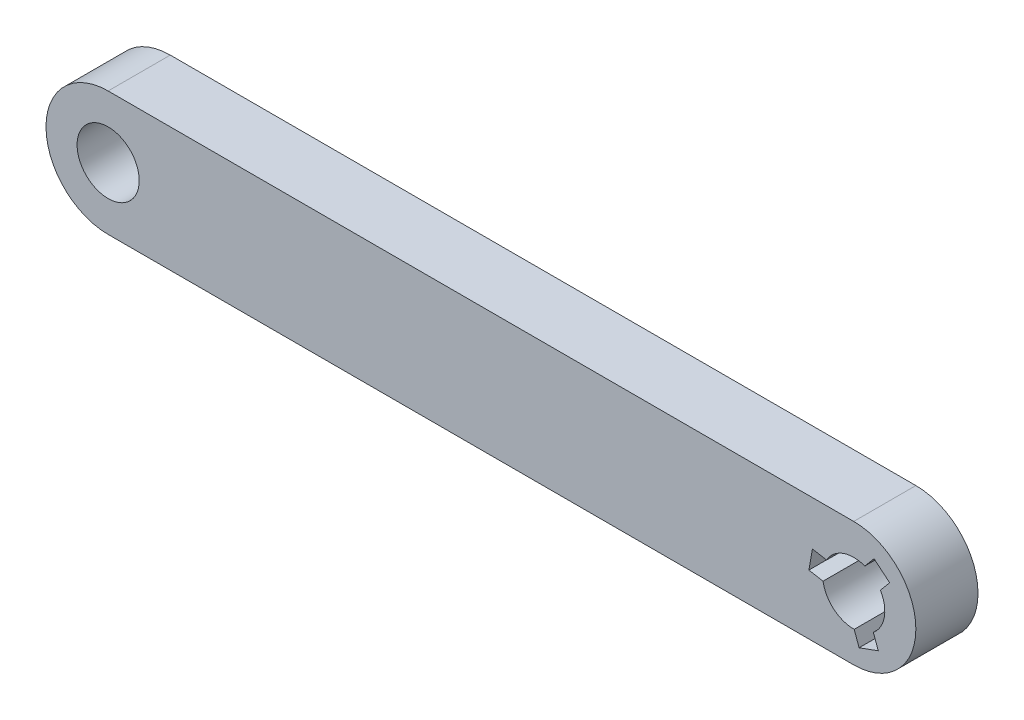
ISO-10303-21;
HEADER;
FILE_DESCRIPTION(('STEP AP214'),'2;1');
FILE_NAME('part.step','',(''),(''),'','','');
FILE_SCHEMA(('AUTOMOTIVE_DESIGN { 1 0 10303 214 1 1 1 1 }'));
ENDSEC;
DATA;
#1=APPLICATION_CONTEXT('core data for automotive mechanical design processes');
#2=APPLICATION_PROTOCOL_DEFINITION('international standard','automotive_design',2000,#1);
#3=PRODUCT_CONTEXT('',#1,'mechanical');
#4=PRODUCT('Part','Part','',(#3));
#5=PRODUCT_RELATED_PRODUCT_CATEGORY('part','',(#4));
#6=PRODUCT_DEFINITION_FORMATION('','',#4);
#7=PRODUCT_DEFINITION_CONTEXT('part definition',#1,'design');
#8=PRODUCT_DEFINITION('design','',#6,#7);
#9=PRODUCT_DEFINITION_SHAPE('','',#8);
#10=(LENGTH_UNIT() NAMED_UNIT(*) SI_UNIT(.MILLI.,.METRE.));
#11=(NAMED_UNIT(*) PLANE_ANGLE_UNIT() SI_UNIT($,.RADIAN.));
#12=(NAMED_UNIT(*) SI_UNIT($,.STERADIAN.) SOLID_ANGLE_UNIT());
#13=UNCERTAINTY_MEASURE_WITH_UNIT(LENGTH_MEASURE(1.E-05),#10,'distance_accuracy_value','');
#14=(GEOMETRIC_REPRESENTATION_CONTEXT(3) GLOBAL_UNCERTAINTY_ASSIGNED_CONTEXT((#13)) GLOBAL_UNIT_ASSIGNED_CONTEXT((#10,
#11,#12)) REPRESENTATION_CONTEXT('',''));
#15=CARTESIAN_POINT('',(0.,0.,0.));
#16=DIRECTION('',(0.,0.,1.));
#17=DIRECTION('',(1.,0.,0.));
#18=AXIS2_PLACEMENT_3D('',#15,#16,#17);
#19=CARTESIAN_POINT('',(0.,-6.35,6.35));
#20=DIRECTION('',(0.,1.,0.));
#21=DIRECTION('',(-1.,0.,0.));
#22=AXIS2_PLACEMENT_3D('',#19,#20,#21);
#23=PLANE('',#22);
#24=DIRECTION('',(1.,0.,0.));
#25=VECTOR('',#24,1.);
#26=CARTESIAN_POINT('',(0.,-6.35,0.));
#27=LINE('',#26,#25);
#28=CARTESIAN_POINT('',(-76.2,-6.35,0.));
#29=VERTEX_POINT('',#28);
#30=CARTESIAN_POINT('',(0.,-6.35,0.));
#31=VERTEX_POINT('',#30);
#32=EDGE_CURVE('E213',#29,#31,#27,.T.);
#33=ORIENTED_EDGE('',*,*,#32,.T.);
#34=DIRECTION('',(0.,0.,-1.));
#35=VECTOR('',#34,1.);
#36=CARTESIAN_POINT('',(0.,-6.35,6.35));
#37=LINE('',#36,#35);
#38=CARTESIAN_POINT('',(0.,-6.35,6.35));
#39=VERTEX_POINT('',#38);
#40=EDGE_CURVE('E11',#39,#31,#37,.T.);
#41=ORIENTED_EDGE('',*,*,#40,.F.);
#42=DIRECTION('',(1.,0.,0.));
#43=VECTOR('',#42,1.);
#44=CARTESIAN_POINT('',(0.,-6.35,6.35));
#45=LINE('',#44,#43);
#46=CARTESIAN_POINT('',(-76.2,-6.35,6.35));
#47=VERTEX_POINT('',#46);
#48=EDGE_CURVE('E166',#47,#39,#45,.T.);
#49=ORIENTED_EDGE('',*,*,#48,.F.);
#50=DIRECTION('',(0.,0.,-1.));
#51=VECTOR('',#50,1.);
#52=CARTESIAN_POINT('',(-76.2,-6.35,6.35));
#53=LINE('',#52,#51);
#54=EDGE_CURVE('E220',#47,#29,#53,.T.);
#55=ORIENTED_EDGE('',*,*,#54,.T.);
#56=EDGE_LOOP('',(#33,#41,#49,#55));
#57=FACE_BOUND('',#56,.T.);
#58=ADVANCED_FACE('F37',(#57),#23,.F.);
#59=CARTESIAN_POINT('',(0.,0.,6.35));
#60=DIRECTION('',(0.,0.,-1.));
#61=DIRECTION('',(-1.,0.,0.));
#62=AXIS2_PLACEMENT_3D('',#59,#60,#61);
#63=CYLINDRICAL_SURFACE('',#62,6.35);
#64=CARTESIAN_POINT('',(0.,0.,0.));
#65=DIRECTION('',(0.,0.,1.));
#66=DIRECTION('',(1.,0.,0.));
#67=AXIS2_PLACEMENT_3D('',#64,#65,#66);
#68=CIRCLE('',#67,6.35);
#69=CARTESIAN_POINT('',(0.,6.35,0.));
#70=VERTEX_POINT('',#69);
#71=EDGE_CURVE('E171',#31,#70,#68,.T.);
#72=ORIENTED_EDGE('',*,*,#71,.T.);
#73=DIRECTION('',(0.,0.,-1.));
#74=VECTOR('',#73,1.);
#75=CARTESIAN_POINT('',(0.,6.35,6.35));
#76=LINE('',#75,#74);
#77=CARTESIAN_POINT('',(0.,6.35,6.35));
#78=VERTEX_POINT('',#77);
#79=EDGE_CURVE('E47',#78,#70,#76,.T.);
#80=ORIENTED_EDGE('',*,*,#79,.F.);
#81=CARTESIAN_POINT('',(0.,0.,6.35));
#82=DIRECTION('',(0.,0.,1.));
#83=DIRECTION('',(1.,0.,0.));
#84=AXIS2_PLACEMENT_3D('',#81,#82,#83);
#85=CIRCLE('',#84,6.35);
#86=EDGE_CURVE('E160',#39,#78,#85,.T.);
#87=ORIENTED_EDGE('',*,*,#86,.F.);
#88=ORIENTED_EDGE('',*,*,#40,.T.);
#89=EDGE_LOOP('',(#72,#80,#87,#88));
#90=FACE_BOUND('',#89,.T.);
#91=ADVANCED_FACE('F170',(#90),#63,.T.);
#92=CARTESIAN_POINT('',(0.,6.35,6.35));
#93=DIRECTION('',(0.,-1.,0.));
#94=DIRECTION('',(0.,0.,-1.));
#95=AXIS2_PLACEMENT_3D('',#92,#93,#94);
#96=PLANE('',#95);
#97=DIRECTION('',(-1.,0.,0.));
#98=VECTOR('',#97,1.);
#99=CARTESIAN_POINT('',(0.,6.35,0.));
#100=LINE('',#99,#98);
#101=CARTESIAN_POINT('',(-76.2,6.35,0.));
#102=VERTEX_POINT('',#101);
#103=EDGE_CURVE('E109',#70,#102,#100,.T.);
#104=ORIENTED_EDGE('',*,*,#103,.T.);
#105=DIRECTION('',(0.,0.,-1.));
#106=VECTOR('',#105,1.);
#107=CARTESIAN_POINT('',(-76.2,6.35,6.35));
#108=LINE('',#107,#106);
#109=CARTESIAN_POINT('',(-76.2,6.35,6.35));
#110=VERTEX_POINT('',#109);
#111=EDGE_CURVE('E172',#110,#102,#108,.T.);
#112=ORIENTED_EDGE('',*,*,#111,.F.);
#113=DIRECTION('',(-1.,0.,0.));
#114=VECTOR('',#113,1.);
#115=CARTESIAN_POINT('',(0.,6.35,6.35));
#116=LINE('',#115,#114);
#117=EDGE_CURVE('E164',#78,#110,#116,.T.);
#118=ORIENTED_EDGE('',*,*,#117,.F.);
#119=ORIENTED_EDGE('',*,*,#79,.T.);
#120=EDGE_LOOP('',(#104,#112,#118,#119));
#121=FACE_BOUND('',#120,.T.);
#122=ADVANCED_FACE('F174',(#121),#96,.F.);
#123=CARTESIAN_POINT('',(0.,0.,6.35));
#124=DIRECTION('',(0.,0.,-1.));
#125=DIRECTION('',(-1.,0.,0.));
#126=AXIS2_PLACEMENT_3D('',#123,#124,#125);
#127=CYLINDRICAL_SURFACE('',#126,3.175);
#128=CARTESIAN_POINT('',(0.,0.,0.));
#129=DIRECTION('',(0.,0.,1.));
#130=DIRECTION('',(1.,0.,0.));
#131=AXIS2_PLACEMENT_3D('',#128,#129,#130);
#132=CIRCLE('',#131,3.175);
#133=CARTESIAN_POINT('',(2.00443461753442,-2.46228894811914,0.));
#134=VERTEX_POINT('',#133);
#135=CARTESIAN_POINT('',(2.72570483788984,1.62823773961419,0.));
#136=VERTEX_POINT('',#135);
#137=EDGE_CURVE('E180',#134,#136,#132,.T.);
#138=ORIENTED_EDGE('',*,*,#137,.F.);
#139=DIRECTION('',(0.,0.,-1.));
#140=VECTOR('',#139,1.);
#141=CARTESIAN_POINT('',(2.00443461753442,-2.46228894811914,6.35));
#142=LINE('',#141,#140);
#143=CARTESIAN_POINT('',(2.00443461753442,-2.46228894811914,6.35));
#144=VERTEX_POINT('',#143);
#145=EDGE_CURVE('E41',#144,#134,#142,.T.);
#146=ORIENTED_EDGE('',*,*,#145,.F.);
#147=CARTESIAN_POINT('',(0.,0.,6.35));
#148=DIRECTION('',(0.,0.,1.));
#149=DIRECTION('',(1.,0.,0.));
#150=AXIS2_PLACEMENT_3D('',#147,#148,#149);
#151=CIRCLE('',#150,3.175);
#152=CARTESIAN_POINT('',(2.72570483788984,1.62823773961419,6.35));
#153=VERTEX_POINT('',#152);
#154=EDGE_CURVE('E219',#144,#153,#151,.T.);
#155=ORIENTED_EDGE('',*,*,#154,.T.);
#156=DIRECTION('',(0.,0.,-1.));
#157=VECTOR('',#156,1.);
#158=CARTESIAN_POINT('',(2.72570483788984,1.62823773961419,6.35));
#159=LINE('',#158,#157);
#160=EDGE_CURVE('E176',#153,#136,#159,.T.);
#161=ORIENTED_EDGE('',*,*,#160,.T.);
#162=EDGE_LOOP('',(#138,#146,#155,#161));
#163=FACE_BOUND('',#162,.T.);
#164=ADVANCED_FACE('F39',(#163),#127,.F.);
#165=CARTESIAN_POINT('',(0.978595895286449,0.356179777259352,6.35));
#166=DIRECTION('',(0.939692620785909,0.342020143325668,0.));
#167=DIRECTION('',(-0.342020143325668,0.939692620785909,0.));
#168=AXIS2_PLACEMENT_3D('',#165,#166,#167);
#169=PLANE('',#168);
#170=DIRECTION('',(0.342020143325668,-0.939692620785909,0.));
#171=VECTOR('',#170,1.);
#172=CARTESIAN_POINT('',(0.978595895286449,0.356179777259352,0.));
#173=LINE('',#172,#171);
#174=CARTESIAN_POINT('',(2.50756274400951,-3.84462211470197,0.));
#175=VERTEX_POINT('',#174);
#176=EDGE_CURVE('E183',#134,#175,#173,.T.);
#177=ORIENTED_EDGE('',*,*,#176,.T.);
#178=DIRECTION('',(0.,0.,-1.));
#179=VECTOR('',#178,1.);
#180=CARTESIAN_POINT('',(2.50756274400951,-3.84462211470197,6.35));
#181=LINE('',#180,#179);
#182=CARTESIAN_POINT('',(2.50756274400951,-3.84462211470197,6.35));
#183=VERTEX_POINT('',#182);
#184=EDGE_CURVE('E246',#183,#175,#181,.T.);
#185=ORIENTED_EDGE('',*,*,#184,.F.);
#186=DIRECTION('',(0.342020143325668,-0.939692620785909,0.));
#187=VECTOR('',#186,1.);
#188=CARTESIAN_POINT('',(0.978595895286449,0.356179777259352,6.35));
#189=LINE('',#188,#187);
#190=EDGE_CURVE('E255',#144,#183,#189,.T.);
#191=ORIENTED_EDGE('',*,*,#190,.F.);
#192=ORIENTED_EDGE('',*,*,#145,.T.);
#193=EDGE_LOOP('',(#177,#185,#191,#192));
#194=FACE_BOUND('',#193,.T.);
#195=ADVANCED_FACE('F254',(#194),#169,.F.);
#196=CARTESIAN_POINT('',(1.52896684872307,-4.20080189196132,6.35));
#197=DIRECTION('',(0.342020143325669,-0.939692620785909,0.));
#198=DIRECTION('',(0.939692620785909,0.342020143325669,0.));
#199=AXIS2_PLACEMENT_3D('',#196,#197,#198);
#200=PLANE('',#199);
#201=DIRECTION('',(-0.939692620785909,-0.342020143325669,0.));
#202=VECTOR('',#201,1.);
#203=CARTESIAN_POINT('',(1.52896684872307,-4.20080189196132,0.));
#204=LINE('',#203,#202);
#205=CARTESIAN_POINT('',(0.550370953436624,-4.55698166922068,0.));
#206=VERTEX_POINT('',#205);
#207=EDGE_CURVE('E185',#175,#206,#204,.T.);
#208=ORIENTED_EDGE('',*,*,#207,.T.);
#209=DIRECTION('',(0.,0.,-1.));
#210=VECTOR('',#209,1.);
#211=CARTESIAN_POINT('',(0.550370953436624,-4.55698166922068,6.35));
#212=LINE('',#211,#210);
#213=CARTESIAN_POINT('',(0.550370953436624,-4.55698166922068,6.35));
#214=VERTEX_POINT('',#213);
#215=EDGE_CURVE('E244',#214,#206,#212,.T.);
#216=ORIENTED_EDGE('',*,*,#215,.F.);
#217=DIRECTION('',(-0.939692620785909,-0.342020143325669,0.));
#218=VECTOR('',#217,1.);
#219=CARTESIAN_POINT('',(1.52896684872307,-4.20080189196132,6.35));
#220=LINE('',#219,#218);
#221=EDGE_CURVE('E315',#183,#214,#220,.T.);
#222=ORIENTED_EDGE('',*,*,#221,.F.);
#223=ORIENTED_EDGE('',*,*,#184,.T.);
#224=EDGE_LOOP('',(#208,#216,#222,#223));
#225=FACE_BOUND('',#224,.T.);
#226=ADVANCED_FACE('F314',(#225),#200,.F.);
#227=CARTESIAN_POINT('',(-0.978595895286445,-0.356179777259351,6.35));
#228=DIRECTION('',(-0.939692620785909,-0.342020143325669,0.));
#229=DIRECTION('',(0.342020143325669,-0.939692620785909,0.));
#230=AXIS2_PLACEMENT_3D('',#227,#228,#229);
#231=PLANE('',#230);
#232=DIRECTION('',(-0.342020143325669,0.939692620785909,0.));
#233=VECTOR('',#232,1.);
#234=CARTESIAN_POINT('',(-0.978595895286445,-0.356179777259351,0.));
#235=LINE('',#234,#233);
#236=CARTESIAN_POINT('',(0.047242826961528,-3.17464850263784,0.));
#237=VERTEX_POINT('',#236);
#238=EDGE_CURVE('E187',#206,#237,#235,.T.);
#239=ORIENTED_EDGE('',*,*,#238,.T.);
#240=DIRECTION('',(0.,0.,-1.));
#241=VECTOR('',#240,1.);
#242=CARTESIAN_POINT('',(0.047242826961528,-3.17464850263784,6.35));
#243=LINE('',#242,#241);
#244=CARTESIAN_POINT('',(0.047242826961528,-3.17464850263784,6.35));
#245=VERTEX_POINT('',#244);
#246=EDGE_CURVE('E242',#245,#237,#243,.T.);
#247=ORIENTED_EDGE('',*,*,#246,.F.);
#248=DIRECTION('',(-0.342020143325669,0.939692620785909,0.));
#249=VECTOR('',#248,1.);
#250=CARTESIAN_POINT('',(-0.978595895286445,-0.356179777259351,6.35));
#251=LINE('',#250,#249);
#252=EDGE_CURVE('E313',#214,#245,#251,.T.);
#253=ORIENTED_EDGE('',*,*,#252,.F.);
#254=ORIENTED_EDGE('',*,*,#215,.T.);
#255=EDGE_LOOP('',(#239,#247,#253,#254));
#256=FACE_BOUND('',#255,.T.);
#257=ADVANCED_FACE('F311',(#256),#231,.F.);
#258=CARTESIAN_POINT('',(0.,0.,6.35));
#259=DIRECTION('',(0.,0.,-1.));
#260=DIRECTION('',(-1.,0.,0.));
#261=AXIS2_PLACEMENT_3D('',#258,#259,#260);
#262=CYLINDRICAL_SURFACE('',#261,3.175);
#263=CARTESIAN_POINT('',(0.,0.,0.));
#264=DIRECTION('',(0.,0.,1.));
#265=DIRECTION('',(1.,0.,0.));
#266=AXIS2_PLACEMENT_3D('',#263,#264,#265);
#267=CIRCLE('',#266,3.175);
#268=CARTESIAN_POINT('',(-3.13462208929605,-0.504746824950184,0.));
#269=VERTEX_POINT('',#268);
#270=EDGE_CURVE('E190',#269,#237,#267,.T.);
#271=ORIENTED_EDGE('',*,*,#270,.F.);
#272=DIRECTION('',(0.,0.,-1.));
#273=VECTOR('',#272,1.);
#274=CARTESIAN_POINT('',(-3.13462208929605,-0.504746824950184,6.35));
#275=LINE('',#274,#273);
#276=CARTESIAN_POINT('',(-3.13462208929605,-0.504746824950184,6.35));
#277=VERTEX_POINT('',#276);
#278=EDGE_CURVE('E240',#277,#269,#275,.T.);
#279=ORIENTED_EDGE('',*,*,#278,.F.);
#280=CARTESIAN_POINT('',(0.,0.,6.35));
#281=DIRECTION('',(0.,0.,1.));
#282=DIRECTION('',(1.,0.,0.));
#283=AXIS2_PLACEMENT_3D('',#280,#281,#282);
#284=CIRCLE('',#283,3.175);
#285=EDGE_CURVE('E308',#277,#245,#284,.T.);
#286=ORIENTED_EDGE('',*,*,#285,.T.);
#287=ORIENTED_EDGE('',*,*,#246,.T.);
#288=EDGE_LOOP('',(#271,#279,#286,#287));
#289=FACE_BOUND('',#288,.T.);
#290=ADVANCED_FACE('F305',(#289),#262,.F.);
#291=CARTESIAN_POINT('',(-0.180837212222342,-1.02557879398692,6.35));
#292=DIRECTION('',(-0.173648177666931,-0.984807753012208,0.));
#293=DIRECTION('',(0.984807753012208,-0.173648177666931,0.));
#294=AXIS2_PLACEMENT_3D('',#291,#292,#293);
#295=PLANE('',#294);
#296=DIRECTION('',(-0.984807753012208,0.173648177666931,0.));
#297=VECTOR('',#296,1.);
#298=CARTESIAN_POINT('',(-0.180837212222342,-1.02557879398692,0.));
#299=LINE('',#298,#297);
#300=CARTESIAN_POINT('',(-4.58332179128812,-0.249301980544669,0.));
#301=VERTEX_POINT('',#300);
#302=EDGE_CURVE('E193',#269,#301,#299,.T.);
#303=ORIENTED_EDGE('',*,*,#302,.T.);
#304=DIRECTION('',(0.,0.,-1.));
#305=VECTOR('',#304,1.);
#306=CARTESIAN_POINT('',(-4.58332179128812,-0.249301980544669,6.35));
#307=LINE('',#306,#305);
#308=CARTESIAN_POINT('',(-4.58332179128812,-0.249301980544669,6.35));
#309=VERTEX_POINT('',#308);
#310=EDGE_CURVE('E237',#309,#301,#307,.T.);
#311=ORIENTED_EDGE('',*,*,#310,.F.);
#312=DIRECTION('',(-0.984807753012208,0.173648177666931,0.));
#313=VECTOR('',#312,1.);
#314=CARTESIAN_POINT('',(-0.180837212222342,-1.02557879398692,6.35));
#315=LINE('',#314,#313);
#316=EDGE_CURVE('E301',#277,#309,#315,.T.);
#317=ORIENTED_EDGE('',*,*,#316,.F.);
#318=ORIENTED_EDGE('',*,*,#278,.T.);
#319=EDGE_LOOP('',(#303,#311,#317,#318));
#320=FACE_BOUND('',#319,.T.);
#321=ADVANCED_FACE('F300',(#320),#295,.F.);
#322=CARTESIAN_POINT('',(-4.40248457906577,0.776276813442248,6.35));
#323=DIRECTION('',(-0.984807753012208,0.173648177666931,0.));
#324=DIRECTION('',(-0.173648177666931,-0.984807753012208,0.));
#325=AXIS2_PLACEMENT_3D('',#322,#323,#324);
#326=PLANE('',#325);
#327=DIRECTION('',(0.173648177666931,0.984807753012208,0.));
#328=VECTOR('',#327,1.);
#329=CARTESIAN_POINT('',(-4.40248457906577,0.776276813442248,0.));
#330=LINE('',#329,#328);
#331=CARTESIAN_POINT('',(-4.22164736684343,1.80185560742916,0.));
#332=VERTEX_POINT('',#331);
#333=EDGE_CURVE('E195',#301,#332,#330,.T.);
#334=ORIENTED_EDGE('',*,*,#333,.T.);
#335=DIRECTION('',(0.,0.,-1.));
#336=VECTOR('',#335,1.);
#337=CARTESIAN_POINT('',(-4.22164736684343,1.80185560742916,6.35));
#338=LINE('',#337,#336);
#339=CARTESIAN_POINT('',(-4.22164736684343,1.80185560742916,6.35));
#340=VERTEX_POINT('',#339);
#341=EDGE_CURVE('E234',#340,#332,#338,.T.);
#342=ORIENTED_EDGE('',*,*,#341,.F.);
#343=DIRECTION('',(0.173648177666931,0.984807753012208,0.));
#344=VECTOR('',#343,1.);
#345=CARTESIAN_POINT('',(-4.40248457906577,0.776276813442248,6.35));
#346=LINE('',#345,#344);
#347=EDGE_CURVE('E296',#309,#340,#346,.T.);
#348=ORIENTED_EDGE('',*,*,#347,.F.);
#349=ORIENTED_EDGE('',*,*,#310,.T.);
#350=EDGE_LOOP('',(#334,#342,#348,#349));
#351=FACE_BOUND('',#350,.T.);
#352=ADVANCED_FACE('F295',(#351),#326,.F.);
#353=CARTESIAN_POINT('',(0.180837212222341,1.02557879398691,6.35));
#354=DIRECTION('',(0.17364817766693,0.984807753012208,0.));
#355=DIRECTION('',(-0.984807753012208,0.17364817766693,0.));
#356=AXIS2_PLACEMENT_3D('',#353,#354,#355);
#357=PLANE('',#356);
#358=DIRECTION('',(0.984807753012208,-0.17364817766693,0.));
#359=VECTOR('',#358,1.);
#360=CARTESIAN_POINT('',(0.180837212222341,1.02557879398691,0.));
#361=LINE('',#360,#359);
#362=CARTESIAN_POINT('',(-2.77294766485136,1.54641076302364,0.));
#363=VERTEX_POINT('',#362);
#364=EDGE_CURVE('E197',#332,#363,#361,.T.);
#365=ORIENTED_EDGE('',*,*,#364,.T.);
#366=DIRECTION('',(0.,0.,-1.));
#367=VECTOR('',#366,1.);
#368=CARTESIAN_POINT('',(-2.77294766485136,1.54641076302364,6.35));
#369=LINE('',#368,#367);
#370=CARTESIAN_POINT('',(-2.77294766485136,1.54641076302364,6.35));
#371=VERTEX_POINT('',#370);
#372=EDGE_CURVE('E232',#371,#363,#369,.T.);
#373=ORIENTED_EDGE('',*,*,#372,.F.);
#374=DIRECTION('',(0.984807753012208,-0.17364817766693,0.));
#375=VECTOR('',#374,1.);
#376=CARTESIAN_POINT('',(0.180837212222341,1.02557879398691,6.35));
#377=LINE('',#376,#375);
#378=EDGE_CURVE('E292',#340,#371,#377,.T.);
#379=ORIENTED_EDGE('',*,*,#378,.F.);
#380=ORIENTED_EDGE('',*,*,#341,.T.);
#381=EDGE_LOOP('',(#365,#373,#379,#380));
#382=FACE_BOUND('',#381,.T.);
#383=ADVANCED_FACE('F289',(#382),#357,.F.);
#384=CARTESIAN_POINT('',(0.,0.,6.35));
#385=DIRECTION('',(0.,0.,-1.));
#386=DIRECTION('',(-1.,0.,0.));
#387=AXIS2_PLACEMENT_3D('',#384,#385,#386);
#388=CYLINDRICAL_SURFACE('',#387,3.175);
#389=CARTESIAN_POINT('',(0.,0.,0.));
#390=DIRECTION('',(0.,0.,1.));
#391=DIRECTION('',(1.,0.,0.));
#392=AXIS2_PLACEMENT_3D('',#389,#390,#391);
#393=CIRCLE('',#392,3.175);
#394=CARTESIAN_POINT('',(1.13018747176163,2.96703577306932,0.));
#395=VERTEX_POINT('',#394);
#396=EDGE_CURVE('E200',#395,#363,#393,.T.);
#397=ORIENTED_EDGE('',*,*,#396,.F.);
#398=DIRECTION('',(0.,0.,-1.));
#399=VECTOR('',#398,1.);
#400=CARTESIAN_POINT('',(1.13018747176163,2.96703577306932,6.35));
#401=LINE('',#400,#399);
#402=CARTESIAN_POINT('',(1.13018747176163,2.96703577306932,6.35));
#403=VERTEX_POINT('',#402);
#404=EDGE_CURVE('E230',#403,#395,#401,.T.);
#405=ORIENTED_EDGE('',*,*,#404,.F.);
#406=CARTESIAN_POINT('',(0.,0.,6.35));
#407=DIRECTION('',(0.,0.,1.));
#408=DIRECTION('',(1.,0.,0.));
#409=AXIS2_PLACEMENT_3D('',#406,#407,#408);
#410=CIRCLE('',#409,3.175);
#411=EDGE_CURVE('E283',#403,#371,#410,.T.);
#412=ORIENTED_EDGE('',*,*,#411,.T.);
#413=ORIENTED_EDGE('',*,*,#372,.T.);
#414=EDGE_LOOP('',(#397,#405,#412,#413));
#415=FACE_BOUND('',#414,.T.);
#416=ADVANCED_FACE('F282',(#415),#388,.F.);
#417=CARTESIAN_POINT('',(-0.797758683064104,0.669399016727563,6.35));
#418=DIRECTION('',(-0.766044443118978,0.64278760968654,0.));
#419=DIRECTION('',(-0.64278760968654,-0.766044443118978,0.));
#420=AXIS2_PLACEMENT_3D('',#417,#418,#419);
#421=PLANE('',#420);
#422=DIRECTION('',(0.64278760968654,0.766044443118978,0.));
#423=VECTOR('',#422,1.);
#424=CARTESIAN_POINT('',(-0.797758683064104,0.669399016727563,0.));
#425=LINE('',#424,#423);
#426=CARTESIAN_POINT('',(2.0757590472786,4.09392409524664,0.));
#427=VERTEX_POINT('',#426);
#428=EDGE_CURVE('E203',#395,#427,#425,.T.);
#429=ORIENTED_EDGE('',*,*,#428,.T.);
#430=DIRECTION('',(0.,0.,-1.));
#431=VECTOR('',#430,1.);
#432=CARTESIAN_POINT('',(2.0757590472786,4.09392409524664,6.35));
#433=LINE('',#432,#431);
#434=CARTESIAN_POINT('',(2.0757590472786,4.09392409524664,6.35));
#435=VERTEX_POINT('',#434);
#436=EDGE_CURVE('E227',#435,#427,#433,.T.);
#437=ORIENTED_EDGE('',*,*,#436,.F.);
#438=DIRECTION('',(0.64278760968654,0.766044443118978,0.));
#439=VECTOR('',#438,1.);
#440=CARTESIAN_POINT('',(-0.797758683064104,0.669399016727563,6.35));
#441=LINE('',#440,#439);
#442=EDGE_CURVE('E278',#403,#435,#441,.T.);
#443=ORIENTED_EDGE('',*,*,#442,.F.);
#444=ORIENTED_EDGE('',*,*,#404,.T.);
#445=EDGE_LOOP('',(#429,#437,#443,#444));
#446=FACE_BOUND('',#445,.T.);
#447=ADVANCED_FACE('F277',(#446),#421,.F.);
#448=CARTESIAN_POINT('',(2.87351773034271,3.42452507851908,6.35));
#449=DIRECTION('',(0.64278760968654,0.766044443118978,0.));
#450=DIRECTION('',(-0.766044443118978,0.64278760968654,0.));
#451=AXIS2_PLACEMENT_3D('',#448,#449,#450);
#452=PLANE('',#451);
#453=DIRECTION('',(0.766044443118978,-0.64278760968654,0.));
#454=VECTOR('',#453,1.);
#455=CARTESIAN_POINT('',(2.87351773034271,3.42452507851908,0.));
#456=LINE('',#455,#454);
#457=CARTESIAN_POINT('',(3.67127641340681,2.75512606179152,0.));
#458=VERTEX_POINT('',#457);
#459=EDGE_CURVE('E205',#427,#458,#456,.T.);
#460=ORIENTED_EDGE('',*,*,#459,.T.);
#461=DIRECTION('',(0.,0.,-1.));
#462=VECTOR('',#461,1.);
#463=CARTESIAN_POINT('',(3.67127641340681,2.75512606179152,6.35));
#464=LINE('',#463,#462);
#465=CARTESIAN_POINT('',(3.67127641340681,2.75512606179152,6.35));
#466=VERTEX_POINT('',#465);
#467=EDGE_CURVE('E224',#466,#458,#464,.T.);
#468=ORIENTED_EDGE('',*,*,#467,.F.);
#469=DIRECTION('',(0.766044443118978,-0.64278760968654,0.));
#470=VECTOR('',#469,1.);
#471=CARTESIAN_POINT('',(2.87351773034271,3.42452507851908,6.35));
#472=LINE('',#471,#470);
#473=EDGE_CURVE('E274',#435,#466,#472,.T.);
#474=ORIENTED_EDGE('',*,*,#473,.F.);
#475=ORIENTED_EDGE('',*,*,#436,.T.);
#476=EDGE_LOOP('',(#460,#468,#474,#475));
#477=FACE_BOUND('',#476,.T.);
#478=ADVANCED_FACE('F271',(#477),#452,.F.);
#479=CARTESIAN_POINT('',(-76.2,0.,6.35));
#480=DIRECTION('',(0.,0.,-1.));
#481=DIRECTION('',(-1.,0.,0.));
#482=AXIS2_PLACEMENT_3D('',#479,#480,#481);
#483=CYLINDRICAL_SURFACE('',#482,3.175);
#484=CARTESIAN_POINT('',(-76.2,0.,6.35));
#485=DIRECTION('',(0.,0.,1.));
#486=DIRECTION('',(1.,0.,0.));
#487=AXIS2_PLACEMENT_3D('',#484,#485,#486);
#488=CIRCLE('',#487,3.175);
#489=CARTESIAN_POINT('',(-73.025,0.,6.35));
#490=VERTEX_POINT('',#489);
#491=EDGE_CURVE('E331',#490,#490,#488,.T.);
#492=ORIENTED_EDGE('',*,*,#491,.T.);
#493=EDGE_LOOP('',(#492));
#494=FACE_BOUND('',#493,.T.);
#495=CARTESIAN_POINT('',(-76.2,0.,0.));
#496=DIRECTION('',(0.,0.,1.));
#497=DIRECTION('',(1.,0.,0.));
#498=AXIS2_PLACEMENT_3D('',#495,#496,#497);
#499=CIRCLE('',#498,3.175);
#500=CARTESIAN_POINT('',(-73.025,0.,0.));
#501=VERTEX_POINT('',#500);
#502=EDGE_CURVE('E210',#501,#501,#499,.T.);
#503=ORIENTED_EDGE('',*,*,#502,.F.);
#504=EDGE_LOOP('',(#503));
#505=FACE_BOUND('',#504,.T.);
#506=ADVANCED_FACE('F335',(#494,#505),#483,.F.);
#507=CARTESIAN_POINT('',(0.797758683064103,-0.669399016727562,6.35));
#508=DIRECTION('',(0.766044443118978,-0.64278760968654,0.));
#509=DIRECTION('',(0.64278760968654,0.766044443118978,0.));
#510=AXIS2_PLACEMENT_3D('',#507,#508,#509);
#511=PLANE('',#510);
#512=DIRECTION('',(-0.64278760968654,-0.766044443118978,0.));
#513=VECTOR('',#512,1.);
#514=CARTESIAN_POINT('',(0.797758683064103,-0.669399016727562,0.));
#515=LINE('',#514,#513);
#516=EDGE_CURVE('E207',#458,#136,#515,.T.);
#517=ORIENTED_EDGE('',*,*,#516,.T.);
#518=ORIENTED_EDGE('',*,*,#160,.F.);
#519=DIRECTION('',(-0.64278760968654,-0.766044443118978,0.));
#520=VECTOR('',#519,1.);
#521=CARTESIAN_POINT('',(0.797758683064103,-0.669399016727562,6.35));
#522=LINE('',#521,#520);
#523=EDGE_CURVE('E329',#466,#153,#522,.T.);
#524=ORIENTED_EDGE('',*,*,#523,.F.);
#525=ORIENTED_EDGE('',*,*,#467,.T.);
#526=EDGE_LOOP('',(#517,#518,#524,#525));
#527=FACE_BOUND('',#526,.T.);
#528=ADVANCED_FACE('F265',(#527),#511,.F.);
#529=CARTESIAN_POINT('',(-76.2,0.,6.35));
#530=DIRECTION('',(0.,0.,-1.));
#531=DIRECTION('',(-1.,0.,0.));
#532=AXIS2_PLACEMENT_3D('',#529,#530,#531);
#533=CYLINDRICAL_SURFACE('',#532,6.35);
#534=CARTESIAN_POINT('',(-76.2,0.,0.));
#535=DIRECTION('',(0.,0.,1.));
#536=DIRECTION('',(1.,0.,0.));
#537=AXIS2_PLACEMENT_3D('',#534,#535,#536);
#538=CIRCLE('',#537,6.35);
#539=EDGE_CURVE('E115',#102,#29,#538,.T.);
#540=ORIENTED_EDGE('',*,*,#539,.T.);
#541=ORIENTED_EDGE('',*,*,#54,.F.);
#542=CARTESIAN_POINT('',(-76.2,0.,6.35));
#543=DIRECTION('',(0.,0.,1.));
#544=DIRECTION('',(1.,0.,0.));
#545=AXIS2_PLACEMENT_3D('',#542,#543,#544);
#546=CIRCLE('',#545,6.35);
#547=EDGE_CURVE('E56',#110,#47,#546,.T.);
#548=ORIENTED_EDGE('',*,*,#547,.F.);
#549=ORIENTED_EDGE('',*,*,#111,.T.);
#550=EDGE_LOOP('',(#540,#541,#548,#549));
#551=FACE_BOUND('',#550,.T.);
#552=ADVANCED_FACE('F339',(#551),#533,.T.);
#553=CARTESIAN_POINT('',(0.,0.,6.35));
#554=DIRECTION('',(0.,0.,1.));
#555=DIRECTION('',(1.,0.,0.));
#556=AXIS2_PLACEMENT_3D('',#553,#554,#555);
#557=PLANE('',#556);
#558=ORIENTED_EDGE('',*,*,#154,.F.);
#559=ORIENTED_EDGE('',*,*,#190,.T.);
#560=ORIENTED_EDGE('',*,*,#221,.T.);
#561=ORIENTED_EDGE('',*,*,#252,.T.);
#562=ORIENTED_EDGE('',*,*,#285,.F.);
#563=ORIENTED_EDGE('',*,*,#316,.T.);
#564=ORIENTED_EDGE('',*,*,#347,.T.);
#565=ORIENTED_EDGE('',*,*,#378,.T.);
#566=ORIENTED_EDGE('',*,*,#411,.F.);
#567=ORIENTED_EDGE('',*,*,#442,.T.);
#568=ORIENTED_EDGE('',*,*,#473,.T.);
#569=ORIENTED_EDGE('',*,*,#523,.T.);
#570=EDGE_LOOP('',(#558,#559,#560,#561,#562,#563,#564,#565,#566,#567,#568,#569));
#571=FACE_BOUND('',#570,.T.);
#572=ORIENTED_EDGE('',*,*,#491,.F.);
#573=EDGE_LOOP('',(#572));
#574=FACE_BOUND('',#573,.T.);
#575=ORIENTED_EDGE('',*,*,#48,.T.);
#576=ORIENTED_EDGE('',*,*,#86,.T.);
#577=ORIENTED_EDGE('',*,*,#117,.T.);
#578=ORIENTED_EDGE('',*,*,#547,.T.);
#579=EDGE_LOOP('',(#575,#576,#577,#578));
#580=FACE_BOUND('',#579,.T.);
#581=ADVANCED_FACE('F162',(#571,#574,#580),#557,.T.);
#582=CARTESIAN_POINT('',(0.,0.,0.));
#583=DIRECTION('',(0.,0.,1.));
#584=DIRECTION('',(1.,0.,0.));
#585=AXIS2_PLACEMENT_3D('',#582,#583,#584);
#586=PLANE('',#585);
#587=ORIENTED_EDGE('',*,*,#137,.T.);
#588=ORIENTED_EDGE('',*,*,#516,.F.);
#589=ORIENTED_EDGE('',*,*,#459,.F.);
#590=ORIENTED_EDGE('',*,*,#428,.F.);
#591=ORIENTED_EDGE('',*,*,#396,.T.);
#592=ORIENTED_EDGE('',*,*,#364,.F.);
#593=ORIENTED_EDGE('',*,*,#333,.F.);
#594=ORIENTED_EDGE('',*,*,#302,.F.);
#595=ORIENTED_EDGE('',*,*,#270,.T.);
#596=ORIENTED_EDGE('',*,*,#238,.F.);
#597=ORIENTED_EDGE('',*,*,#207,.F.);
#598=ORIENTED_EDGE('',*,*,#176,.F.);
#599=EDGE_LOOP('',(#587,#588,#589,#590,#591,#592,#593,#594,#595,#596,#597,#598));
#600=FACE_BOUND('',#599,.T.);
#601=ORIENTED_EDGE('',*,*,#502,.T.);
#602=EDGE_LOOP('',(#601));
#603=FACE_BOUND('',#602,.T.);
#604=ORIENTED_EDGE('',*,*,#32,.F.);
#605=ORIENTED_EDGE('',*,*,#539,.F.);
#606=ORIENTED_EDGE('',*,*,#103,.F.);
#607=ORIENTED_EDGE('',*,*,#71,.F.);
#608=EDGE_LOOP('',(#604,#605,#606,#607));
#609=FACE_BOUND('',#608,.T.);
#610=ADVANCED_FACE('F258',(#600,#603,#609),#586,.F.);
#611=CLOSED_SHELL('',(#58,#91,#122,#164,#195,#226,#257,#290,#321,#352,#383,#416,#447,#478,#506,
#528,#552,#581,#610));
#612=MANIFOLD_SOLID_BREP('B2',#611);
#613=ADVANCED_BREP_SHAPE_REPRESENTATION('',(#18,#612),#14);
#614=SHAPE_DEFINITION_REPRESENTATION(#9,#613);
ENDSEC;
END-ISO-10303-21;
